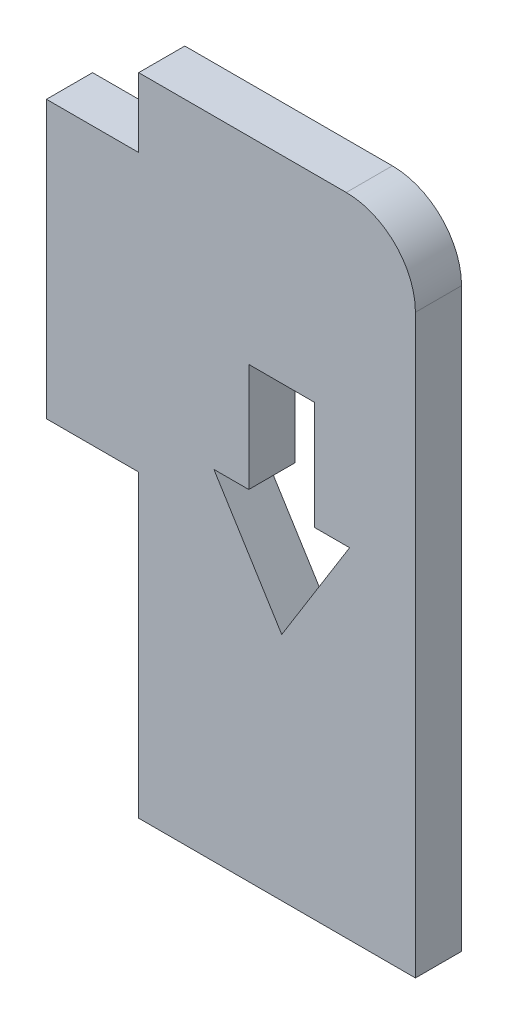
ISO-10303-21;
HEADER;
FILE_DESCRIPTION(('STEP AP214'),'2;1');
FILE_NAME('part.step','',(''),(''),'','','');
FILE_SCHEMA(('AUTOMOTIVE_DESIGN { 1 0 10303 214 1 1 1 1 }'));
ENDSEC;
DATA;
#1=APPLICATION_CONTEXT('core data for automotive mechanical design processes');
#2=APPLICATION_PROTOCOL_DEFINITION('international standard','automotive_design',2000,#1);
#3=PRODUCT_CONTEXT('',#1,'mechanical');
#4=PRODUCT('Part','Part','',(#3));
#5=PRODUCT_RELATED_PRODUCT_CATEGORY('part','',(#4));
#6=PRODUCT_DEFINITION_FORMATION('','',#4);
#7=PRODUCT_DEFINITION_CONTEXT('part definition',#1,'design');
#8=PRODUCT_DEFINITION('design','',#6,#7);
#9=PRODUCT_DEFINITION_SHAPE('','',#8);
#10=(LENGTH_UNIT() NAMED_UNIT(*) SI_UNIT(.MILLI.,.METRE.));
#11=(NAMED_UNIT(*) PLANE_ANGLE_UNIT() SI_UNIT($,.RADIAN.));
#12=(NAMED_UNIT(*) SI_UNIT($,.STERADIAN.) SOLID_ANGLE_UNIT());
#13=UNCERTAINTY_MEASURE_WITH_UNIT(LENGTH_MEASURE(1.E-05),#10,'distance_accuracy_value','');
#14=(GEOMETRIC_REPRESENTATION_CONTEXT(3) GLOBAL_UNCERTAINTY_ASSIGNED_CONTEXT((#13)) GLOBAL_UNIT_ASSIGNED_CONTEXT((#10,
#11,#12)) REPRESENTATION_CONTEXT('',''));
#15=CARTESIAN_POINT('',(0.,0.,0.));
#16=DIRECTION('',(0.,0.,1.));
#17=DIRECTION('',(1.,0.,0.));
#18=AXIS2_PLACEMENT_3D('',#15,#16,#17);
#19=CARTESIAN_POINT('',(4.,0.,2.));
#20=DIRECTION('',(1.,0.,0.));
#21=DIRECTION('',(0.,1.,0.));
#22=AXIS2_PLACEMENT_3D('',#19,#20,#21);
#23=PLANE('',#22);
#24=DIRECTION('',(0.,-1.,0.));
#25=VECTOR('',#24,1.);
#26=CARTESIAN_POINT('',(4.,0.,0.));
#27=LINE('',#26,#25);
#28=CARTESIAN_POINT('',(4.,-12.,0.));
#29=VERTEX_POINT('',#28);
#30=CARTESIAN_POINT('',(4.,-25.,0.));
#31=VERTEX_POINT('',#30);
#32=EDGE_CURVE('E225',#29,#31,#27,.T.);
#33=ORIENTED_EDGE('',*,*,#32,.T.);
#34=DIRECTION('',(0.,0.,-1.));
#35=VECTOR('',#34,1.);
#36=CARTESIAN_POINT('',(4.,-25.,2.));
#37=LINE('',#36,#35);
#38=CARTESIAN_POINT('',(4.,-25.,2.));
#39=VERTEX_POINT('',#38);
#40=EDGE_CURVE('E313',#39,#31,#37,.T.);
#41=ORIENTED_EDGE('',*,*,#40,.F.);
#42=DIRECTION('',(0.,-1.,0.));
#43=VECTOR('',#42,1.);
#44=CARTESIAN_POINT('',(4.,0.,2.));
#45=LINE('',#44,#43);
#46=CARTESIAN_POINT('',(4.,-12.,2.));
#47=VERTEX_POINT('',#46);
#48=EDGE_CURVE('E240',#47,#39,#45,.T.);
#49=ORIENTED_EDGE('',*,*,#48,.F.);
#50=DIRECTION('',(0.,0.,-1.));
#51=VECTOR('',#50,1.);
#52=CARTESIAN_POINT('',(4.,-12.,2.));
#53=LINE('',#52,#51);
#54=EDGE_CURVE('E266',#47,#29,#53,.T.);
#55=ORIENTED_EDGE('',*,*,#54,.T.);
#56=EDGE_LOOP('',(#33,#41,#49,#55));
#57=FACE_BOUND('',#56,.T.);
#58=ADVANCED_FACE('F38',(#57),#23,.F.);
#59=CARTESIAN_POINT('',(0.,-25.,2.));
#60=DIRECTION('',(0.,1.,0.));
#61=DIRECTION('',(0.,0.,1.));
#62=AXIS2_PLACEMENT_3D('',#59,#60,#61);
#63=PLANE('',#62);
#64=DIRECTION('',(1.,0.,0.));
#65=VECTOR('',#64,1.);
#66=CARTESIAN_POINT('',(0.,-25.,0.));
#67=LINE('',#66,#65);
#68=CARTESIAN_POINT('',(16.,-25.,0.));
#69=VERTEX_POINT('',#68);
#70=EDGE_CURVE('E270',#31,#69,#67,.T.);
#71=ORIENTED_EDGE('',*,*,#70,.T.);
#72=DIRECTION('',(0.,0.,-1.));
#73=VECTOR('',#72,1.);
#74=CARTESIAN_POINT('',(16.,-25.,2.));
#75=LINE('',#74,#73);
#76=CARTESIAN_POINT('',(16.,-25.,2.));
#77=VERTEX_POINT('',#76);
#78=EDGE_CURVE('E309',#77,#69,#75,.T.);
#79=ORIENTED_EDGE('',*,*,#78,.F.);
#80=DIRECTION('',(1.,0.,0.));
#81=VECTOR('',#80,1.);
#82=CARTESIAN_POINT('',(0.,-25.,2.));
#83=LINE('',#82,#81);
#84=EDGE_CURVE('E244',#39,#77,#83,.T.);
#85=ORIENTED_EDGE('',*,*,#84,.F.);
#86=ORIENTED_EDGE('',*,*,#40,.T.);
#87=EDGE_LOOP('',(#71,#79,#85,#86));
#88=FACE_BOUND('',#87,.T.);
#89=ADVANCED_FACE('F352',(#88),#63,.F.);
#90=CARTESIAN_POINT('',(16.,0.,2.));
#91=DIRECTION('',(-1.,0.,0.));
#92=DIRECTION('',(0.,0.,1.));
#93=AXIS2_PLACEMENT_3D('',#90,#91,#92);
#94=PLANE('',#93);
#95=DIRECTION('',(0.,1.,0.));
#96=VECTOR('',#95,1.);
#97=CARTESIAN_POINT('',(16.,0.,0.));
#98=LINE('',#97,#96);
#99=CARTESIAN_POINT('',(16.,0.,0.));
#100=VERTEX_POINT('',#99);
#101=EDGE_CURVE('E273',#69,#100,#98,.T.);
#102=ORIENTED_EDGE('',*,*,#101,.T.);
#103=DIRECTION('',(0.,0.,-1.));
#104=VECTOR('',#103,1.);
#105=CARTESIAN_POINT('',(16.,0.,2.));
#106=LINE('',#105,#104);
#107=CARTESIAN_POINT('',(16.,0.,2.));
#108=VERTEX_POINT('',#107);
#109=EDGE_CURVE('E47',#100,#108,#106,.F.);
#110=ORIENTED_EDGE('',*,*,#109,.T.);
#111=DIRECTION('',(0.,1.,0.));
#112=VECTOR('',#111,1.);
#113=CARTESIAN_POINT('',(16.,0.,2.));
#114=LINE('',#113,#112);
#115=EDGE_CURVE('E248',#77,#108,#114,.T.);
#116=ORIENTED_EDGE('',*,*,#115,.F.);
#117=ORIENTED_EDGE('',*,*,#78,.T.);
#118=EDGE_LOOP('',(#102,#110,#116,#117));
#119=FACE_BOUND('',#118,.T.);
#120=ADVANCED_FACE('F357',(#119),#94,.F.);
#121=CARTESIAN_POINT('',(0.,3.,2.));
#122=DIRECTION('',(0.,-1.,0.));
#123=DIRECTION('',(1.,0.,0.));
#124=AXIS2_PLACEMENT_3D('',#121,#122,#123);
#125=PLANE('',#124);
#126=DIRECTION('',(-1.,0.,0.));
#127=VECTOR('',#126,1.);
#128=CARTESIAN_POINT('',(0.,3.,2.));
#129=LINE('',#128,#127);
#130=CARTESIAN_POINT('',(13.,3.,2.));
#131=VERTEX_POINT('',#130);
#132=CARTESIAN_POINT('',(4.,3.,2.));
#133=VERTEX_POINT('',#132);
#134=EDGE_CURVE('E251',#131,#133,#129,.T.);
#135=ORIENTED_EDGE('',*,*,#134,.F.);
#136=DIRECTION('',(0.,0.,-1.));
#137=VECTOR('',#136,1.);
#138=CARTESIAN_POINT('',(13.,3.,2.));
#139=LINE('',#138,#137);
#140=CARTESIAN_POINT('',(13.,3.,0.));
#141=VERTEX_POINT('',#140);
#142=EDGE_CURVE('E317',#131,#141,#139,.T.);
#143=ORIENTED_EDGE('',*,*,#142,.T.);
#144=DIRECTION('',(-1.,0.,0.));
#145=VECTOR('',#144,1.);
#146=CARTESIAN_POINT('',(0.,3.,0.));
#147=LINE('',#146,#145);
#148=CARTESIAN_POINT('',(4.,3.,0.));
#149=VERTEX_POINT('',#148);
#150=EDGE_CURVE('E276',#141,#149,#147,.T.);
#151=ORIENTED_EDGE('',*,*,#150,.T.);
#152=DIRECTION('',(0.,0.,-1.));
#153=VECTOR('',#152,1.);
#154=CARTESIAN_POINT('',(4.,3.,2.));
#155=LINE('',#154,#153);
#156=EDGE_CURVE('E305',#133,#149,#155,.T.);
#157=ORIENTED_EDGE('',*,*,#156,.F.);
#158=EDGE_LOOP('',(#135,#143,#151,#157));
#159=FACE_BOUND('',#158,.T.);
#160=ADVANCED_FACE('F326',(#159),#125,.F.);
#161=CARTESIAN_POINT('',(4.,0.,2.));
#162=DIRECTION('',(1.,0.,0.));
#163=DIRECTION('',(0.,0.,-1.));
#164=AXIS2_PLACEMENT_3D('',#161,#162,#163);
#165=PLANE('',#164);
#166=DIRECTION('',(0.,-1.,0.));
#167=VECTOR('',#166,1.);
#168=CARTESIAN_POINT('',(4.,0.,0.));
#169=LINE('',#168,#167);
#170=CARTESIAN_POINT('',(4.,0.,0.));
#171=VERTEX_POINT('',#170);
#172=EDGE_CURVE('E279',#149,#171,#169,.T.);
#173=ORIENTED_EDGE('',*,*,#172,.T.);
#174=DIRECTION('',(0.,0.,-1.));
#175=VECTOR('',#174,1.);
#176=CARTESIAN_POINT('',(4.,0.,2.));
#177=LINE('',#176,#175);
#178=CARTESIAN_POINT('',(4.,0.,2.));
#179=VERTEX_POINT('',#178);
#180=EDGE_CURVE('E301',#179,#171,#177,.T.);
#181=ORIENTED_EDGE('',*,*,#180,.F.);
#182=DIRECTION('',(0.,-1.,0.));
#183=VECTOR('',#182,1.);
#184=CARTESIAN_POINT('',(4.,0.,2.));
#185=LINE('',#184,#183);
#186=EDGE_CURVE('E254',#133,#179,#185,.T.);
#187=ORIENTED_EDGE('',*,*,#186,.F.);
#188=ORIENTED_EDGE('',*,*,#156,.T.);
#189=EDGE_LOOP('',(#173,#181,#187,#188));
#190=FACE_BOUND('',#189,.T.);
#191=ADVANCED_FACE('F335',(#190),#165,.F.);
#192=CARTESIAN_POINT('',(0.,0.,2.));
#193=DIRECTION('',(0.,-1.,0.));
#194=DIRECTION('',(1.,0.,0.));
#195=AXIS2_PLACEMENT_3D('',#192,#193,#194);
#196=PLANE('',#195);
#197=DIRECTION('',(-1.,0.,0.));
#198=VECTOR('',#197,1.);
#199=CARTESIAN_POINT('',(0.,0.,0.));
#200=LINE('',#199,#198);
#201=CARTESIAN_POINT('',(0.,0.,0.));
#202=VERTEX_POINT('',#201);
#203=EDGE_CURVE('E282',#171,#202,#200,.T.);
#204=ORIENTED_EDGE('',*,*,#203,.T.);
#205=DIRECTION('',(0.,0.,-1.));
#206=VECTOR('',#205,1.);
#207=CARTESIAN_POINT('',(0.,0.,2.));
#208=LINE('',#207,#206);
#209=CARTESIAN_POINT('',(0.,0.,2.));
#210=VERTEX_POINT('',#209);
#211=EDGE_CURVE('E297',#210,#202,#208,.T.);
#212=ORIENTED_EDGE('',*,*,#211,.F.);
#213=DIRECTION('',(-1.,0.,0.));
#214=VECTOR('',#213,1.);
#215=CARTESIAN_POINT('',(0.,0.,2.));
#216=LINE('',#215,#214);
#217=EDGE_CURVE('E257',#179,#210,#216,.T.);
#218=ORIENTED_EDGE('',*,*,#217,.F.);
#219=ORIENTED_EDGE('',*,*,#180,.T.);
#220=EDGE_LOOP('',(#204,#212,#218,#219));
#221=FACE_BOUND('',#220,.T.);
#222=ADVANCED_FACE('F339',(#221),#196,.F.);
#223=CARTESIAN_POINT('',(0.,0.,2.));
#224=DIRECTION('',(1.,0.,0.));
#225=DIRECTION('',(0.,0.,-1.));
#226=AXIS2_PLACEMENT_3D('',#223,#224,#225);
#227=PLANE('',#226);
#228=DIRECTION('',(0.,-1.,0.));
#229=VECTOR('',#228,1.);
#230=CARTESIAN_POINT('',(0.,0.,0.));
#231=LINE('',#230,#229);
#232=CARTESIAN_POINT('',(0.,-12.,0.));
#233=VERTEX_POINT('',#232);
#234=EDGE_CURVE('E285',#202,#233,#231,.T.);
#235=ORIENTED_EDGE('',*,*,#234,.T.);
#236=DIRECTION('',(0.,0.,-1.));
#237=VECTOR('',#236,1.);
#238=CARTESIAN_POINT('',(0.,-12.,2.));
#239=LINE('',#238,#237);
#240=CARTESIAN_POINT('',(0.,-12.,2.));
#241=VERTEX_POINT('',#240);
#242=EDGE_CURVE('E293',#241,#233,#239,.T.);
#243=ORIENTED_EDGE('',*,*,#242,.F.);
#244=DIRECTION('',(0.,-1.,0.));
#245=VECTOR('',#244,1.);
#246=CARTESIAN_POINT('',(0.,0.,2.));
#247=LINE('',#246,#245);
#248=EDGE_CURVE('E260',#210,#241,#247,.T.);
#249=ORIENTED_EDGE('',*,*,#248,.F.);
#250=ORIENTED_EDGE('',*,*,#211,.T.);
#251=EDGE_LOOP('',(#235,#243,#249,#250));
#252=FACE_BOUND('',#251,.T.);
#253=ADVANCED_FACE('F369',(#252),#227,.F.);
#254=CARTESIAN_POINT('',(0.,-12.,2.));
#255=DIRECTION('',(0.,1.,0.));
#256=DIRECTION('',(0.,0.,1.));
#257=AXIS2_PLACEMENT_3D('',#254,#255,#256);
#258=PLANE('',#257);
#259=DIRECTION('',(1.,0.,0.));
#260=VECTOR('',#259,1.);
#261=CARTESIAN_POINT('',(0.,-12.,0.));
#262=LINE('',#261,#260);
#263=EDGE_CURVE('E245',#233,#29,#262,.T.);
#264=ORIENTED_EDGE('',*,*,#263,.T.);
#265=ORIENTED_EDGE('',*,*,#54,.F.);
#266=DIRECTION('',(1.,0.,0.));
#267=VECTOR('',#266,1.);
#268=CARTESIAN_POINT('',(0.,-12.,2.));
#269=LINE('',#268,#267);
#270=EDGE_CURVE('E263',#241,#47,#269,.T.);
#271=ORIENTED_EDGE('',*,*,#270,.F.);
#272=ORIENTED_EDGE('',*,*,#242,.T.);
#273=EDGE_LOOP('',(#264,#265,#271,#272));
#274=FACE_BOUND('',#273,.T.);
#275=ADVANCED_FACE('F372',(#274),#258,.F.);
#276=CARTESIAN_POINT('',(0.,0.,2.));
#277=DIRECTION('',(0.,0.,1.));
#278=DIRECTION('',(1.,0.,0.));
#279=AXIS2_PLACEMENT_3D('',#276,#277,#278);
#280=PLANE('',#279);
#281=DIRECTION('',(0.,-1.,0.));
#282=VECTOR('',#281,1.);
#283=CARTESIAN_POINT('',(8.77294126566062,-5.57008760873415,2.));
#284=LINE('',#283,#282);
#285=CARTESIAN_POINT('',(8.77294126566062,-5.57008760873415,2.));
#286=VERTEX_POINT('',#285);
#287=CARTESIAN_POINT('',(8.77294126566062,-10.2686378183035,2.));
#288=VERTEX_POINT('',#287);
#289=EDGE_CURVE('E159',#286,#288,#284,.T.);
#290=ORIENTED_EDGE('',*,*,#289,.F.);
#291=DIRECTION('',(-1.,0.,0.));
#292=VECTOR('',#291,1.);
#293=CARTESIAN_POINT('',(11.6328239486049,-5.57008760873415,2.));
#294=LINE('',#293,#292);
#295=CARTESIAN_POINT('',(11.6328239486049,-5.57008760873415,2.));
#296=VERTEX_POINT('',#295);
#297=EDGE_CURVE('E180',#296,#286,#294,.T.);
#298=ORIENTED_EDGE('',*,*,#297,.F.);
#299=DIRECTION('',(0.,1.,0.));
#300=VECTOR('',#299,1.);
#301=CARTESIAN_POINT('',(11.6328239486049,-5.57008760873415,2.));
#302=LINE('',#301,#300);
#303=CARTESIAN_POINT('',(11.6328239486049,-10.2686378183035,2.));
#304=VERTEX_POINT('',#303);
#305=EDGE_CURVE('E184',#304,#296,#302,.T.);
#306=ORIENTED_EDGE('',*,*,#305,.F.);
#307=DIRECTION('',(-1.,0.,0.));
#308=VECTOR('',#307,1.);
#309=CARTESIAN_POINT('',(11.6328239486049,-10.2686378183035,2.));
#310=LINE('',#309,#308);
#311=CARTESIAN_POINT('',(13.1449882977054,-10.2686378183035,2.));
#312=VERTEX_POINT('',#311);
#313=EDGE_CURVE('E215',#312,#304,#310,.T.);
#314=ORIENTED_EDGE('',*,*,#313,.F.);
#315=DIRECTION('',(0.528064436524394,0.849204304557021,0.));
#316=VECTOR('',#315,1.);
#317=CARTESIAN_POINT('',(13.1449882977054,-10.2686378183035,2.));
#318=LINE('',#317,#316);
#319=CARTESIAN_POINT('',(10.2028826071328,-14.9999710497937,2.));
#320=VERTEX_POINT('',#319);
#321=EDGE_CURVE('E211',#320,#312,#318,.T.);
#322=ORIENTED_EDGE('',*,*,#321,.F.);
#323=DIRECTION('',(0.528064436524394,-0.849204304557021,0.));
#324=VECTOR('',#323,1.);
#325=CARTESIAN_POINT('',(7.26077691656009,-10.2686378183035,2.));
#326=LINE('',#325,#324);
#327=CARTESIAN_POINT('',(7.26077691656009,-10.2686378183035,2.));
#328=VERTEX_POINT('',#327);
#329=EDGE_CURVE('E207',#328,#320,#326,.T.);
#330=ORIENTED_EDGE('',*,*,#329,.F.);
#331=DIRECTION('',(-1.,0.,0.));
#332=VECTOR('',#331,1.);
#333=CARTESIAN_POINT('',(8.77294126566062,-10.2686378183035,2.));
#334=LINE('',#333,#332);
#335=EDGE_CURVE('E204',#288,#328,#334,.T.);
#336=ORIENTED_EDGE('',*,*,#335,.F.);
#337=EDGE_LOOP('',(#290,#298,#306,#314,#322,#330,#336));
#338=FACE_BOUND('',#337,.T.);
#339=ORIENTED_EDGE('',*,*,#115,.T.);
#340=CARTESIAN_POINT('',(13.,0.,2.));
#341=DIRECTION('',(0.,0.,1.));
#342=DIRECTION('',(1.,0.,0.));
#343=AXIS2_PLACEMENT_3D('',#340,#341,#342);
#344=CIRCLE('',#343,3.);
#345=EDGE_CURVE('E11',#108,#131,#344,.T.);
#346=ORIENTED_EDGE('',*,*,#345,.T.);
#347=ORIENTED_EDGE('',*,*,#134,.T.);
#348=ORIENTED_EDGE('',*,*,#186,.T.);
#349=ORIENTED_EDGE('',*,*,#217,.T.);
#350=ORIENTED_EDGE('',*,*,#248,.T.);
#351=ORIENTED_EDGE('',*,*,#270,.T.);
#352=ORIENTED_EDGE('',*,*,#48,.T.);
#353=ORIENTED_EDGE('',*,*,#84,.T.);
#354=EDGE_LOOP('',(#339,#346,#347,#348,#349,#350,#351,#352,#353));
#355=FACE_BOUND('',#354,.T.);
#356=ADVANCED_FACE('F343',(#338,#355),#280,.T.);
#357=CARTESIAN_POINT('',(0.,0.,0.));
#358=DIRECTION('',(0.,0.,1.));
#359=DIRECTION('',(1.,0.,0.));
#360=AXIS2_PLACEMENT_3D('',#357,#358,#359);
#361=PLANE('',#360);
#362=DIRECTION('',(-1.,0.,0.));
#363=VECTOR('',#362,1.);
#364=CARTESIAN_POINT('',(11.6328239486049,-5.57008760873415,0.));
#365=LINE('',#364,#363);
#366=CARTESIAN_POINT('',(11.6328239486049,-5.57008760873415,0.));
#367=VERTEX_POINT('',#366);
#368=CARTESIAN_POINT('',(8.77294126566062,-5.57008760873415,0.));
#369=VERTEX_POINT('',#368);
#370=EDGE_CURVE('E165',#367,#369,#365,.T.);
#371=ORIENTED_EDGE('',*,*,#370,.T.);
#372=DIRECTION('',(0.,-1.,0.));
#373=VECTOR('',#372,1.);
#374=CARTESIAN_POINT('',(8.77294126566062,-5.57008760873415,0.));
#375=LINE('',#374,#373);
#376=CARTESIAN_POINT('',(8.77294126566062,-10.2686378183035,0.));
#377=VERTEX_POINT('',#376);
#378=EDGE_CURVE('E156',#369,#377,#375,.T.);
#379=ORIENTED_EDGE('',*,*,#378,.T.);
#380=DIRECTION('',(-1.,0.,0.));
#381=VECTOR('',#380,1.);
#382=CARTESIAN_POINT('',(8.77294126566062,-10.2686378183035,0.));
#383=LINE('',#382,#381);
#384=CARTESIAN_POINT('',(7.26077691656009,-10.2686378183035,0.));
#385=VERTEX_POINT('',#384);
#386=EDGE_CURVE('E169',#377,#385,#383,.T.);
#387=ORIENTED_EDGE('',*,*,#386,.T.);
#388=DIRECTION('',(0.528064436524394,-0.849204304557021,0.));
#389=VECTOR('',#388,1.);
#390=CARTESIAN_POINT('',(7.26077691656009,-10.2686378183035,0.));
#391=LINE('',#390,#389);
#392=CARTESIAN_POINT('',(10.2028826071328,-14.9999710497937,0.));
#393=VERTEX_POINT('',#392);
#394=EDGE_CURVE('E174',#385,#393,#391,.T.);
#395=ORIENTED_EDGE('',*,*,#394,.T.);
#396=DIRECTION('',(0.528064436524394,0.849204304557021,0.));
#397=VECTOR('',#396,1.);
#398=CARTESIAN_POINT('',(13.1449882977054,-10.2686378183035,0.));
#399=LINE('',#398,#397);
#400=CARTESIAN_POINT('',(13.1449882977054,-10.2686378183035,0.));
#401=VERTEX_POINT('',#400);
#402=EDGE_CURVE('E189',#393,#401,#399,.T.);
#403=ORIENTED_EDGE('',*,*,#402,.T.);
#404=DIRECTION('',(-1.,0.,0.));
#405=VECTOR('',#404,1.);
#406=CARTESIAN_POINT('',(11.6328239486049,-10.2686378183035,0.));
#407=LINE('',#406,#405);
#408=CARTESIAN_POINT('',(11.6328239486049,-10.2686378183035,0.));
#409=VERTEX_POINT('',#408);
#410=EDGE_CURVE('E193',#401,#409,#407,.T.);
#411=ORIENTED_EDGE('',*,*,#410,.T.);
#412=DIRECTION('',(0.,1.,0.));
#413=VECTOR('',#412,1.);
#414=CARTESIAN_POINT('',(11.6328239486049,-5.57008760873415,0.));
#415=LINE('',#414,#413);
#416=EDGE_CURVE('E197',#409,#367,#415,.T.);
#417=ORIENTED_EDGE('',*,*,#416,.T.);
#418=EDGE_LOOP('',(#371,#379,#387,#395,#403,#411,#417));
#419=FACE_BOUND('',#418,.T.);
#420=ORIENTED_EDGE('',*,*,#150,.F.);
#421=CARTESIAN_POINT('',(13.,0.,0.));
#422=DIRECTION('',(0.,0.,1.));
#423=DIRECTION('',(1.,0.,0.));
#424=AXIS2_PLACEMENT_3D('',#421,#422,#423);
#425=CIRCLE('',#424,3.);
#426=EDGE_CURVE('E61',#141,#100,#425,.F.);
#427=ORIENTED_EDGE('',*,*,#426,.T.);
#428=ORIENTED_EDGE('',*,*,#101,.F.);
#429=ORIENTED_EDGE('',*,*,#70,.F.);
#430=ORIENTED_EDGE('',*,*,#32,.F.);
#431=ORIENTED_EDGE('',*,*,#263,.F.);
#432=ORIENTED_EDGE('',*,*,#234,.F.);
#433=ORIENTED_EDGE('',*,*,#203,.F.);
#434=ORIENTED_EDGE('',*,*,#172,.F.);
#435=EDGE_LOOP('',(#420,#427,#428,#429,#430,#431,#432,#433,#434));
#436=FACE_BOUND('',#435,.T.);
#437=ADVANCED_FACE('F176',(#419,#436),#361,.F.);
#438=CARTESIAN_POINT('',(8.77294126566062,-5.57008760873415,0.));
#439=DIRECTION('',(-1.,0.,0.));
#440=DIRECTION('',(0.,0.,1.));
#441=AXIS2_PLACEMENT_3D('',#438,#439,#440);
#442=PLANE('',#441);
#443=ORIENTED_EDGE('',*,*,#289,.T.);
#444=DIRECTION('',(0.,0.,1.));
#445=VECTOR('',#444,1.);
#446=CARTESIAN_POINT('',(8.77294126566062,-10.2686378183035,0.));
#447=LINE('',#446,#445);
#448=EDGE_CURVE('E152',#377,#288,#447,.T.);
#449=ORIENTED_EDGE('',*,*,#448,.F.);
#450=ORIENTED_EDGE('',*,*,#378,.F.);
#451=DIRECTION('',(0.,0.,1.));
#452=VECTOR('',#451,1.);
#453=CARTESIAN_POINT('',(8.77294126566062,-5.57008760873415,0.));
#454=LINE('',#453,#452);
#455=EDGE_CURVE('E222',#369,#286,#454,.T.);
#456=ORIENTED_EDGE('',*,*,#455,.T.);
#457=EDGE_LOOP('',(#443,#449,#450,#456));
#458=FACE_BOUND('',#457,.T.);
#459=ADVANCED_FACE('F154',(#458),#442,.F.);
#460=CARTESIAN_POINT('',(11.6328239486049,-5.57008760873415,0.));
#461=DIRECTION('',(0.,1.,0.));
#462=DIRECTION('',(-1.,0.,0.));
#463=AXIS2_PLACEMENT_3D('',#460,#461,#462);
#464=PLANE('',#463);
#465=ORIENTED_EDGE('',*,*,#297,.T.);
#466=ORIENTED_EDGE('',*,*,#455,.F.);
#467=ORIENTED_EDGE('',*,*,#370,.F.);
#468=DIRECTION('',(0.,0.,1.));
#469=VECTOR('',#468,1.);
#470=CARTESIAN_POINT('',(11.6328239486049,-5.57008760873415,0.));
#471=LINE('',#470,#469);
#472=EDGE_CURVE('E226',#367,#296,#471,.T.);
#473=ORIENTED_EDGE('',*,*,#472,.T.);
#474=EDGE_LOOP('',(#465,#466,#467,#473));
#475=FACE_BOUND('',#474,.T.);
#476=ADVANCED_FACE('F383',(#475),#464,.F.);
#477=CARTESIAN_POINT('',(11.6328239486049,-5.57008760873415,0.));
#478=DIRECTION('',(1.,0.,0.));
#479=DIRECTION('',(0.,0.,-1.));
#480=AXIS2_PLACEMENT_3D('',#477,#478,#479);
#481=PLANE('',#480);
#482=ORIENTED_EDGE('',*,*,#305,.T.);
#483=ORIENTED_EDGE('',*,*,#472,.F.);
#484=ORIENTED_EDGE('',*,*,#416,.F.);
#485=DIRECTION('',(0.,0.,1.));
#486=VECTOR('',#485,1.);
#487=CARTESIAN_POINT('',(11.6328239486049,-10.2686378183035,0.));
#488=LINE('',#487,#486);
#489=EDGE_CURVE('E229',#409,#304,#488,.T.);
#490=ORIENTED_EDGE('',*,*,#489,.T.);
#491=EDGE_LOOP('',(#482,#483,#484,#490));
#492=FACE_BOUND('',#491,.T.);
#493=ADVANCED_FACE('F395',(#492),#481,.F.);
#494=CARTESIAN_POINT('',(11.6328239486049,-10.2686378183035,0.));
#495=DIRECTION('',(0.,1.,0.));
#496=DIRECTION('',(-1.,0.,0.));
#497=AXIS2_PLACEMENT_3D('',#494,#495,#496);
#498=PLANE('',#497);
#499=ORIENTED_EDGE('',*,*,#313,.T.);
#500=ORIENTED_EDGE('',*,*,#489,.F.);
#501=ORIENTED_EDGE('',*,*,#410,.F.);
#502=DIRECTION('',(0.,0.,1.));
#503=VECTOR('',#502,1.);
#504=CARTESIAN_POINT('',(13.1449882977054,-10.2686378183035,0.));
#505=LINE('',#504,#503);
#506=EDGE_CURVE('E232',#401,#312,#505,.T.);
#507=ORIENTED_EDGE('',*,*,#506,.T.);
#508=EDGE_LOOP('',(#499,#500,#501,#507));
#509=FACE_BOUND('',#508,.T.);
#510=ADVANCED_FACE('F391',(#509),#498,.F.);
#511=CARTESIAN_POINT('',(13.1449882977054,-10.2686378183035,0.));
#512=DIRECTION('',(0.849204304557021,-0.528064436524394,0.));
#513=DIRECTION('',(0.528064436524394,0.849204304557021,0.));
#514=AXIS2_PLACEMENT_3D('',#511,#512,#513);
#515=PLANE('',#514);
#516=ORIENTED_EDGE('',*,*,#321,.T.);
#517=ORIENTED_EDGE('',*,*,#506,.F.);
#518=ORIENTED_EDGE('',*,*,#402,.F.);
#519=DIRECTION('',(0.,0.,1.));
#520=VECTOR('',#519,1.);
#521=CARTESIAN_POINT('',(10.2028826071328,-14.9999710497937,0.));
#522=LINE('',#521,#520);
#523=EDGE_CURVE('E235',#393,#320,#522,.T.);
#524=ORIENTED_EDGE('',*,*,#523,.T.);
#525=EDGE_LOOP('',(#516,#517,#518,#524));
#526=FACE_BOUND('',#525,.T.);
#527=ADVANCED_FACE('F387',(#526),#515,.F.);
#528=CARTESIAN_POINT('',(7.26077691656009,-10.2686378183035,0.));
#529=DIRECTION('',(-0.849204304557021,-0.528064436524394,0.));
#530=DIRECTION('',(0.528064436524394,-0.849204304557021,0.));
#531=AXIS2_PLACEMENT_3D('',#528,#529,#530);
#532=PLANE('',#531);
#533=ORIENTED_EDGE('',*,*,#329,.T.);
#534=ORIENTED_EDGE('',*,*,#523,.F.);
#535=ORIENTED_EDGE('',*,*,#394,.F.);
#536=DIRECTION('',(0.,0.,1.));
#537=VECTOR('',#536,1.);
#538=CARTESIAN_POINT('',(7.26077691656009,-10.2686378183035,0.));
#539=LINE('',#538,#537);
#540=EDGE_CURVE('E164',#385,#328,#539,.T.);
#541=ORIENTED_EDGE('',*,*,#540,.T.);
#542=EDGE_LOOP('',(#533,#534,#535,#541));
#543=FACE_BOUND('',#542,.T.);
#544=ADVANCED_FACE('F349',(#543),#532,.F.);
#545=CARTESIAN_POINT('',(8.77294126566062,-10.2686378183035,0.));
#546=DIRECTION('',(0.,1.,0.));
#547=DIRECTION('',(-1.,0.,0.));
#548=AXIS2_PLACEMENT_3D('',#545,#546,#547);
#549=PLANE('',#548);
#550=ORIENTED_EDGE('',*,*,#335,.T.);
#551=ORIENTED_EDGE('',*,*,#540,.F.);
#552=ORIENTED_EDGE('',*,*,#386,.F.);
#553=ORIENTED_EDGE('',*,*,#448,.T.);
#554=EDGE_LOOP('',(#550,#551,#552,#553));
#555=FACE_BOUND('',#554,.T.);
#556=ADVANCED_FACE('F170',(#555),#549,.F.);
#557=CARTESIAN_POINT('',(13.,0.,2.));
#558=DIRECTION('',(0.,0.,-1.));
#559=DIRECTION('',(-1.,0.,0.));
#560=AXIS2_PLACEMENT_3D('',#557,#558,#559);
#561=CYLINDRICAL_SURFACE('',#560,3.);
#562=ORIENTED_EDGE('',*,*,#345,.F.);
#563=ORIENTED_EDGE('',*,*,#109,.F.);
#564=ORIENTED_EDGE('',*,*,#426,.F.);
#565=ORIENTED_EDGE('',*,*,#142,.F.);
#566=EDGE_LOOP('',(#562,#563,#564,#565));
#567=FACE_BOUND('',#566,.T.);
#568=ADVANCED_FACE('F40',(#567),#561,.T.);
#569=CLOSED_SHELL('',(#58,#89,#120,#160,#191,#222,#253,#275,#356,#437,#459,#476,#493,#510,#527,
#544,#556,#568));
#570=MANIFOLD_SOLID_BREP('B2',#569);
#571=ADVANCED_BREP_SHAPE_REPRESENTATION('',(#18,#570),#14);
#572=SHAPE_DEFINITION_REPRESENTATION(#9,#571);
ENDSEC;
END-ISO-10303-21;
